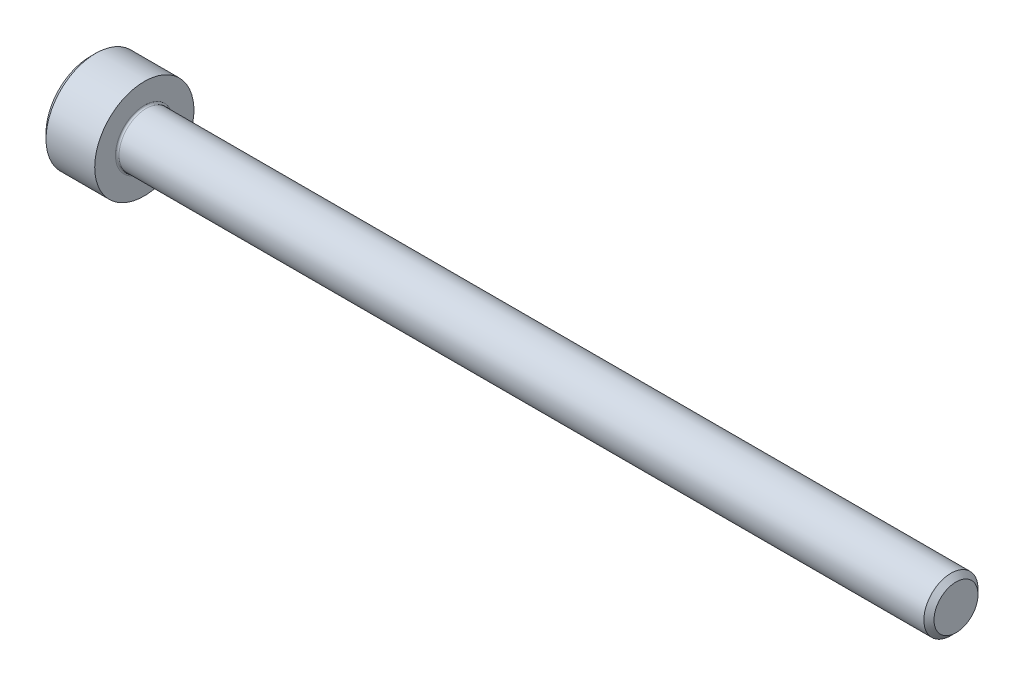
ISO-10303-21;
HEADER;
FILE_DESCRIPTION(('STEP AP214'),'2;1');
FILE_NAME('part.step','',(''),(''),'','','');
FILE_SCHEMA(('AUTOMOTIVE_DESIGN { 1 0 10303 214 1 1 1 1 }'));
ENDSEC;
DATA;
#1=APPLICATION_CONTEXT('core data for automotive mechanical design processes');
#2=APPLICATION_PROTOCOL_DEFINITION('international standard','automotive_design',2000,#1);
#3=PRODUCT_CONTEXT('',#1,'mechanical');
#4=PRODUCT('Part','Part','',(#3));
#5=PRODUCT_RELATED_PRODUCT_CATEGORY('part','',(#4));
#6=PRODUCT_DEFINITION_FORMATION('','',#4);
#7=PRODUCT_DEFINITION_CONTEXT('part definition',#1,'design');
#8=PRODUCT_DEFINITION('design','',#6,#7);
#9=PRODUCT_DEFINITION_SHAPE('','',#8);
#10=(LENGTH_UNIT() NAMED_UNIT(*) SI_UNIT(.MILLI.,.METRE.));
#11=(NAMED_UNIT(*) PLANE_ANGLE_UNIT() SI_UNIT($,.RADIAN.));
#12=(NAMED_UNIT(*) SI_UNIT($,.STERADIAN.) SOLID_ANGLE_UNIT());
#13=UNCERTAINTY_MEASURE_WITH_UNIT(LENGTH_MEASURE(1.E-05),#10,'distance_accuracy_value','');
#14=(GEOMETRIC_REPRESENTATION_CONTEXT(3) GLOBAL_UNCERTAINTY_ASSIGNED_CONTEXT((#13)) GLOBAL_UNIT_ASSIGNED_CONTEXT((#10,
#11,#12)) REPRESENTATION_CONTEXT('',''));
#15=CARTESIAN_POINT('',(0.,0.,0.));
#16=DIRECTION('',(0.,0.,1.));
#17=DIRECTION('',(1.,0.,0.));
#18=AXIS2_PLACEMENT_3D('',#15,#16,#17);
#19=CARTESIAN_POINT('',(0.,0.,0.));
#20=DIRECTION('',(-1.,0.,0.));
#21=DIRECTION('',(0.,0.,1.));
#22=AXIS2_PLACEMENT_3D('',#19,#20,#21);
#23=PLANE('',#22);
#24=DIRECTION('',(0.,-0.5,0.866025403784439));
#25=VECTOR('',#24,1.);
#26=CARTESIAN_POINT('',(0.,1.47801668912544,0.));
#27=LINE('',#26,#25);
#28=CARTESIAN_POINT('',(0.,1.47801668912544,0.));
#29=VERTEX_POINT('',#28);
#30=CARTESIAN_POINT('',(0.,0.739008344562719,1.28));
#31=VERTEX_POINT('',#30);
#32=EDGE_CURVE('E386',#29,#31,#27,.T.);
#33=ORIENTED_EDGE('',*,*,#32,.T.);
#34=DIRECTION('',(0.,1.,0.));
#35=VECTOR('',#34,1.);
#36=CARTESIAN_POINT('',(0.,-0.739008344562723,1.28));
#37=LINE('',#36,#35);
#38=CARTESIAN_POINT('',(0.,-0.739008344562723,1.28));
#39=VERTEX_POINT('',#38);
#40=EDGE_CURVE('E130',#39,#31,#37,.T.);
#41=ORIENTED_EDGE('',*,*,#40,.F.);
#42=DIRECTION('',(0.,-0.500000000000001,-0.866025403784438));
#43=VECTOR('',#42,1.);
#44=CARTESIAN_POINT('',(0.,-0.739008344562723,1.28));
#45=LINE('',#44,#43);
#46=CARTESIAN_POINT('',(0.,-1.47801668912545,0.));
#47=VERTEX_POINT('',#46);
#48=EDGE_CURVE('E389',#39,#47,#45,.T.);
#49=ORIENTED_EDGE('',*,*,#48,.T.);
#50=DIRECTION('',(0.,0.5,-0.866025403784439));
#51=VECTOR('',#50,1.);
#52=CARTESIAN_POINT('',(0.,-1.47801668912545,0.));
#53=LINE('',#52,#51);
#54=CARTESIAN_POINT('',(0.,-0.739008344562725,-1.28));
#55=VERTEX_POINT('',#54);
#56=EDGE_CURVE('E392',#47,#55,#53,.T.);
#57=ORIENTED_EDGE('',*,*,#56,.T.);
#58=DIRECTION('',(0.,-1.,0.));
#59=VECTOR('',#58,1.);
#60=CARTESIAN_POINT('',(0.,0.739008344562717,-1.28));
#61=LINE('',#60,#59);
#62=CARTESIAN_POINT('',(0.,0.739008344562717,-1.28));
#63=VERTEX_POINT('',#62);
#64=EDGE_CURVE('E395',#63,#55,#61,.T.);
#65=ORIENTED_EDGE('',*,*,#64,.F.);
#66=DIRECTION('',(0.,-0.500000000000001,-0.866025403784438));
#67=VECTOR('',#66,1.);
#68=CARTESIAN_POINT('',(0.,1.47801668912544,0.));
#69=LINE('',#68,#67);
#70=EDGE_CURVE('E125',#29,#63,#69,.T.);
#71=ORIENTED_EDGE('',*,*,#70,.F.);
#72=EDGE_LOOP('',(#33,#41,#49,#57,#65,#71));
#73=FACE_BOUND('',#72,.T.);
#74=CARTESIAN_POINT('',(0.,0.,0.));
#75=DIRECTION('',(-1.,0.,0.));
#76=DIRECTION('',(0.,0.,1.));
#77=AXIS2_PLACEMENT_3D('',#74,#75,#76);
#78=CIRCLE('',#77,2.45);
#79=CARTESIAN_POINT('',(0.,0.,2.45));
#80=VERTEX_POINT('',#79);
#81=EDGE_CURVE('E141',#80,#80,#78,.T.);
#82=ORIENTED_EDGE('',*,*,#81,.T.);
#83=EDGE_LOOP('',(#82));
#84=FACE_BOUND('',#83,.T.);
#85=ADVANCED_FACE('F34',(#73,#84),#23,.T.);
#86=CARTESIAN_POINT('',(48.,1.2195,0.));
#87=DIRECTION('',(1.,0.,0.));
#88=DIRECTION('',(0.,0.,-1.));
#89=AXIS2_PLACEMENT_3D('',#86,#87,#88);
#90=PLANE('',#89);
#91=CARTESIAN_POINT('',(48.,0.,0.));
#92=DIRECTION('',(-1.,0.,0.));
#93=DIRECTION('',(0.,0.,1.));
#94=AXIS2_PLACEMENT_3D('',#91,#92,#93);
#95=CIRCLE('',#94,1.2195);
#96=CARTESIAN_POINT('',(48.,0.,1.2195));
#97=VERTEX_POINT('',#96);
#98=EDGE_CURVE('E154',#97,#97,#95,.T.);
#99=ORIENTED_EDGE('',*,*,#98,.F.);
#100=EDGE_LOOP('',(#99));
#101=FACE_BOUND('',#100,.T.);
#102=ADVANCED_FACE('F175',(#101),#90,.T.);
#103=CARTESIAN_POINT('',(48.,0.,0.));
#104=DIRECTION('',(-1.,0.,0.));
#105=DIRECTION('',(0.,0.,1.));
#106=AXIS2_PLACEMENT_3D('',#103,#104,#105);
#107=CONICAL_SURFACE('',#106,1.2195,0.785398163397254);
#108=CARTESIAN_POINT('',(47.7195,0.,0.));
#109=DIRECTION('',(-1.,0.,0.));
#110=DIRECTION('',(0.,0.,1.));
#111=AXIS2_PLACEMENT_3D('',#108,#109,#110);
#112=CIRCLE('',#111,1.49999999999994);
#113=CARTESIAN_POINT('',(47.7195,0.,1.49999999999994));
#114=VERTEX_POINT('',#113);
#115=EDGE_CURVE('E151',#114,#114,#112,.T.);
#116=ORIENTED_EDGE('',*,*,#115,.F.);
#117=EDGE_LOOP('',(#116));
#118=FACE_BOUND('',#117,.T.);
#119=ORIENTED_EDGE('',*,*,#98,.T.);
#120=EDGE_LOOP('',(#119));
#121=FACE_BOUND('',#120,.T.);
#122=ADVANCED_FACE('F181',(#118,#121),#107,.T.);
#123=CARTESIAN_POINT('',(-31.75,0.,0.));
#124=DIRECTION('',(-1.,0.,0.));
#125=DIRECTION('',(0.,0.,1.));
#126=AXIS2_PLACEMENT_3D('',#123,#124,#125);
#127=CYLINDRICAL_SURFACE('',#126,1.49999999999997);
#128=CARTESIAN_POINT('',(3.1,0.,0.));
#129=DIRECTION('',(1.,0.,0.));
#130=DIRECTION('',(0.,0.,-1.));
#131=AXIS2_PLACEMENT_3D('',#128,#129,#130);
#132=CIRCLE('',#131,1.49999999999997);
#133=CARTESIAN_POINT('',(3.1,0.,-1.49999999999997));
#134=VERTEX_POINT('',#133);
#135=EDGE_CURVE('E11',#134,#134,#132,.T.);
#136=ORIENTED_EDGE('',*,*,#135,.T.);
#137=EDGE_LOOP('',(#136));
#138=FACE_BOUND('',#137,.T.);
#139=ORIENTED_EDGE('',*,*,#115,.T.);
#140=EDGE_LOOP('',(#139));
#141=FACE_BOUND('',#140,.T.);
#142=ADVANCED_FACE('F192',(#138,#141),#127,.T.);
#143=CARTESIAN_POINT('',(3.,2.75,0.));
#144=DIRECTION('',(1.,0.,0.));
#145=DIRECTION('',(0.,0.,-1.));
#146=AXIS2_PLACEMENT_3D('',#143,#144,#145);
#147=PLANE('',#146);
#148=CARTESIAN_POINT('',(3.,0.,0.));
#149=DIRECTION('',(1.,0.,0.));
#150=DIRECTION('',(0.,0.,-1.));
#151=AXIS2_PLACEMENT_3D('',#148,#149,#150);
#152=CIRCLE('',#151,1.59999999999997);
#153=CARTESIAN_POINT('',(3.,0.,-1.59999999999997));
#154=VERTEX_POINT('',#153);
#155=EDGE_CURVE('E42',#154,#154,#152,.F.);
#156=ORIENTED_EDGE('',*,*,#155,.T.);
#157=EDGE_LOOP('',(#156));
#158=FACE_BOUND('',#157,.T.);
#159=CARTESIAN_POINT('',(3.,0.,0.));
#160=DIRECTION('',(-1.,0.,0.));
#161=DIRECTION('',(0.,0.,1.));
#162=AXIS2_PLACEMENT_3D('',#159,#160,#161);
#163=CIRCLE('',#162,2.75);
#164=CARTESIAN_POINT('',(3.,0.,2.75));
#165=VERTEX_POINT('',#164);
#166=EDGE_CURVE('E148',#165,#165,#163,.T.);
#167=ORIENTED_EDGE('',*,*,#166,.F.);
#168=EDGE_LOOP('',(#167));
#169=FACE_BOUND('',#168,.T.);
#170=ADVANCED_FACE('F159',(#158,#169),#147,.T.);
#171=CARTESIAN_POINT('',(-31.75,0.,0.));
#172=DIRECTION('',(-1.,0.,0.));
#173=DIRECTION('',(0.,0.,1.));
#174=AXIS2_PLACEMENT_3D('',#171,#172,#173);
#175=CYLINDRICAL_SURFACE('',#174,2.75);
#176=ORIENTED_EDGE('',*,*,#166,.T.);
#177=EDGE_LOOP('',(#176));
#178=FACE_BOUND('',#177,.T.);
#179=CARTESIAN_POINT('',(0.300000000000002,0.,0.));
#180=DIRECTION('',(-1.,0.,0.));
#181=DIRECTION('',(0.,0.,1.));
#182=AXIS2_PLACEMENT_3D('',#179,#180,#181);
#183=CIRCLE('',#182,2.75);
#184=CARTESIAN_POINT('',(0.300000000000002,0.,2.75));
#185=VERTEX_POINT('',#184);
#186=EDGE_CURVE('E145',#185,#185,#183,.T.);
#187=ORIENTED_EDGE('',*,*,#186,.F.);
#188=EDGE_LOOP('',(#187));
#189=FACE_BOUND('',#188,.T.);
#190=ADVANCED_FACE('F170',(#178,#189),#175,.T.);
#191=CARTESIAN_POINT('',(0.,0.,0.));
#192=DIRECTION('',(1.,0.,0.));
#193=DIRECTION('',(0.,0.,-1.));
#194=AXIS2_PLACEMENT_3D('',#191,#192,#193);
#195=CONICAL_SURFACE('',#194,2.45,0.785398163397447);
#196=ORIENTED_EDGE('',*,*,#186,.T.);
#197=EDGE_LOOP('',(#196));
#198=FACE_BOUND('',#197,.T.);
#199=ORIENTED_EDGE('',*,*,#81,.F.);
#200=EDGE_LOOP('',(#199));
#201=FACE_BOUND('',#200,.T.);
#202=ADVANCED_FACE('F163',(#198,#201),#195,.T.);
#203=CARTESIAN_POINT('',(3.1,0.,0.));
#204=DIRECTION('',(1.,0.,0.));
#205=DIRECTION('',(0.,0.,-1.));
#206=AXIS2_PLACEMENT_3D('',#203,#204,#205);
#207=TOROIDAL_SURFACE('',#206,1.59999999999997,0.1);
#208=ORIENTED_EDGE('',*,*,#135,.F.);
#209=EDGE_LOOP('',(#208));
#210=FACE_BOUND('',#209,.T.);
#211=ORIENTED_EDGE('',*,*,#155,.F.);
#212=EDGE_LOOP('',(#211));
#213=FACE_BOUND('',#212,.T.);
#214=ADVANCED_FACE('F36',(#210,#213),#207,.F.);
#215=CARTESIAN_POINT('',(1.3,1.47801668912544,0.));
#216=DIRECTION('',(0.,-0.866025403784439,-0.5));
#217=DIRECTION('',(0.,0.5,-0.866025403784439));
#218=AXIS2_PLACEMENT_3D('',#215,#216,#217);
#219=PLANE('',#218);
#220=ORIENTED_EDGE('',*,*,#32,.F.);
#221=DIRECTION('',(-1.,0.,0.));
#222=VECTOR('',#221,1.);
#223=CARTESIAN_POINT('',(1.3,1.47801668912544,0.));
#224=LINE('',#223,#222);
#225=CARTESIAN_POINT('',(1.3,1.47801668912544,0.));
#226=VERTEX_POINT('',#225);
#227=EDGE_CURVE('E376',#226,#29,#224,.T.);
#228=ORIENTED_EDGE('',*,*,#227,.F.);
#229=DIRECTION('',(0.,-0.5,0.866025403784439));
#230=VECTOR('',#229,1.);
#231=CARTESIAN_POINT('',(1.3,1.47801668912544,0.));
#232=LINE('',#231,#230);
#233=CARTESIAN_POINT('',(1.3,1.10851251684408,0.639999999999998));
#234=VERTEX_POINT('',#233);
#235=EDGE_CURVE('E117',#226,#234,#232,.T.);
#236=ORIENTED_EDGE('',*,*,#235,.T.);
#237=CARTESIAN_POINT('',(1.3,0.739008344562719,1.28));
#238=VERTEX_POINT('',#237);
#239=EDGE_CURVE('E108',#234,#238,#232,.T.);
#240=ORIENTED_EDGE('',*,*,#239,.T.);
#241=DIRECTION('',(-1.,0.,0.));
#242=VECTOR('',#241,1.);
#243=CARTESIAN_POINT('',(1.3,0.739008344562719,1.28));
#244=LINE('',#243,#242);
#245=EDGE_CURVE('E122',#238,#31,#244,.T.);
#246=ORIENTED_EDGE('',*,*,#245,.T.);
#247=EDGE_LOOP('',(#220,#228,#236,#240,#246));
#248=FACE_BOUND('',#247,.T.);
#249=ADVANCED_FACE('F121',(#248),#219,.T.);
#250=CARTESIAN_POINT('',(1.3,-0.739008344562723,1.28));
#251=DIRECTION('',(0.,0.,1.));
#252=DIRECTION('',(0.,-1.,0.));
#253=AXIS2_PLACEMENT_3D('',#250,#251,#252);
#254=PLANE('',#253);
#255=ORIENTED_EDGE('',*,*,#40,.T.);
#256=ORIENTED_EDGE('',*,*,#245,.F.);
#257=DIRECTION('',(0.,1.,0.));
#258=VECTOR('',#257,1.);
#259=CARTESIAN_POINT('',(1.3,-0.739008344562723,1.28));
#260=LINE('',#259,#258);
#261=CARTESIAN_POINT('',(1.3,0.,1.28));
#262=VERTEX_POINT('',#261);
#263=EDGE_CURVE('E105',#262,#238,#260,.T.);
#264=ORIENTED_EDGE('',*,*,#263,.F.);
#265=CARTESIAN_POINT('',(1.3,-0.739008344562723,1.28));
#266=VERTEX_POINT('',#265);
#267=EDGE_CURVE('E116',#266,#262,#260,.T.);
#268=ORIENTED_EDGE('',*,*,#267,.F.);
#269=DIRECTION('',(-1.,0.,0.));
#270=VECTOR('',#269,1.);
#271=CARTESIAN_POINT('',(1.3,-0.739008344562723,1.28));
#272=LINE('',#271,#270);
#273=EDGE_CURVE('E132',#266,#39,#272,.T.);
#274=ORIENTED_EDGE('',*,*,#273,.T.);
#275=EDGE_LOOP('',(#255,#256,#264,#268,#274));
#276=FACE_BOUND('',#275,.T.);
#277=ADVANCED_FACE('F127',(#276),#254,.F.);
#278=CARTESIAN_POINT('',(1.3,-0.739008344562723,1.28));
#279=DIRECTION('',(0.,0.866025403784438,-0.500000000000001));
#280=DIRECTION('',(0.,0.500000000000001,0.866025403784438));
#281=AXIS2_PLACEMENT_3D('',#278,#279,#280);
#282=PLANE('',#281);
#283=ORIENTED_EDGE('',*,*,#48,.F.);
#284=ORIENTED_EDGE('',*,*,#273,.F.);
#285=DIRECTION('',(0.,-0.500000000000001,-0.866025403784438));
#286=VECTOR('',#285,1.);
#287=CARTESIAN_POINT('',(1.3,-0.739008344562723,1.28));
#288=LINE('',#287,#286);
#289=CARTESIAN_POINT('',(1.3,-1.10851251684408,0.640000000000003));
#290=VERTEX_POINT('',#289);
#291=EDGE_CURVE('E415',#266,#290,#288,.T.);
#292=ORIENTED_EDGE('',*,*,#291,.T.);
#293=CARTESIAN_POINT('',(1.3,-1.47801668912545,0.));
#294=VERTEX_POINT('',#293);
#295=EDGE_CURVE('E404',#290,#294,#288,.T.);
#296=ORIENTED_EDGE('',*,*,#295,.T.);
#297=DIRECTION('',(-1.,0.,0.));
#298=VECTOR('',#297,1.);
#299=CARTESIAN_POINT('',(1.3,-1.47801668912545,0.));
#300=LINE('',#299,#298);
#301=EDGE_CURVE('E137',#294,#47,#300,.T.);
#302=ORIENTED_EDGE('',*,*,#301,.T.);
#303=EDGE_LOOP('',(#283,#284,#292,#296,#302));
#304=FACE_BOUND('',#303,.T.);
#305=ADVANCED_FACE('F267',(#304),#282,.T.);
#306=CARTESIAN_POINT('',(1.3,-1.47801668912545,0.));
#307=DIRECTION('',(0.,0.866025403784439,0.5));
#308=DIRECTION('',(0.,-0.5,0.866025403784439));
#309=AXIS2_PLACEMENT_3D('',#306,#307,#308);
#310=PLANE('',#309);
#311=ORIENTED_EDGE('',*,*,#56,.F.);
#312=ORIENTED_EDGE('',*,*,#301,.F.);
#313=DIRECTION('',(0.,0.5,-0.866025403784439));
#314=VECTOR('',#313,1.);
#315=CARTESIAN_POINT('',(1.3,-1.47801668912545,0.));
#316=LINE('',#315,#314);
#317=CARTESIAN_POINT('',(1.3,-1.10851251684409,-0.640000000000002));
#318=VERTEX_POINT('',#317);
#319=EDGE_CURVE('E382',#294,#318,#316,.T.);
#320=ORIENTED_EDGE('',*,*,#319,.T.);
#321=CARTESIAN_POINT('',(1.3,-0.739008344562725,-1.28));
#322=VERTEX_POINT('',#321);
#323=EDGE_CURVE('E414',#318,#322,#316,.T.);
#324=ORIENTED_EDGE('',*,*,#323,.T.);
#325=DIRECTION('',(-1.,0.,0.));
#326=VECTOR('',#325,1.);
#327=CARTESIAN_POINT('',(1.3,-0.739008344562725,-1.28));
#328=LINE('',#327,#326);
#329=EDGE_CURVE('E375',#322,#55,#328,.T.);
#330=ORIENTED_EDGE('',*,*,#329,.T.);
#331=EDGE_LOOP('',(#311,#312,#320,#324,#330));
#332=FACE_BOUND('',#331,.T.);
#333=ADVANCED_FACE('F275',(#332),#310,.T.);
#334=CARTESIAN_POINT('',(1.3,0.739008344562717,-1.28));
#335=DIRECTION('',(0.,0.,-1.));
#336=DIRECTION('',(0.,1.,0.));
#337=AXIS2_PLACEMENT_3D('',#334,#335,#336);
#338=PLANE('',#337);
#339=ORIENTED_EDGE('',*,*,#64,.T.);
#340=ORIENTED_EDGE('',*,*,#329,.F.);
#341=DIRECTION('',(0.,-1.,0.));
#342=VECTOR('',#341,1.);
#343=CARTESIAN_POINT('',(1.3,0.739008344562717,-1.28));
#344=LINE('',#343,#342);
#345=CARTESIAN_POINT('',(1.3,0.,-1.28));
#346=VERTEX_POINT('',#345);
#347=EDGE_CURVE('E379',#346,#322,#344,.T.);
#348=ORIENTED_EDGE('',*,*,#347,.F.);
#349=CARTESIAN_POINT('',(1.3,0.739008344562717,-1.28));
#350=VERTEX_POINT('',#349);
#351=EDGE_CURVE('E49',#350,#346,#344,.T.);
#352=ORIENTED_EDGE('',*,*,#351,.F.);
#353=DIRECTION('',(-1.,0.,0.));
#354=VECTOR('',#353,1.);
#355=CARTESIAN_POINT('',(1.3,0.739008344562717,-1.28));
#356=LINE('',#355,#354);
#357=EDGE_CURVE('E372',#350,#63,#356,.T.);
#358=ORIENTED_EDGE('',*,*,#357,.T.);
#359=EDGE_LOOP('',(#339,#340,#348,#352,#358));
#360=FACE_BOUND('',#359,.T.);
#361=ADVANCED_FACE('F284',(#360),#338,.F.);
#362=CARTESIAN_POINT('',(1.3,1.47801668912544,0.));
#363=DIRECTION('',(0.,0.866025403784438,-0.500000000000001));
#364=DIRECTION('',(0.,0.500000000000001,0.866025403784438));
#365=AXIS2_PLACEMENT_3D('',#362,#363,#364);
#366=PLANE('',#365);
#367=ORIENTED_EDGE('',*,*,#70,.T.);
#368=ORIENTED_EDGE('',*,*,#357,.F.);
#369=DIRECTION('',(0.,-0.500000000000001,-0.866025403784438));
#370=VECTOR('',#369,1.);
#371=CARTESIAN_POINT('',(1.3,1.47801668912544,0.));
#372=LINE('',#371,#370);
#373=CARTESIAN_POINT('',(1.3,1.10851251684408,-0.640000000000001));
#374=VERTEX_POINT('',#373);
#375=EDGE_CURVE('E362',#374,#350,#372,.T.);
#376=ORIENTED_EDGE('',*,*,#375,.F.);
#377=EDGE_CURVE('E368',#226,#374,#372,.T.);
#378=ORIENTED_EDGE('',*,*,#377,.F.);
#379=ORIENTED_EDGE('',*,*,#227,.T.);
#380=EDGE_LOOP('',(#367,#368,#376,#378,#379));
#381=FACE_BOUND('',#380,.T.);
#382=ADVANCED_FACE('F293',(#381),#366,.F.);
#383=CARTESIAN_POINT('',(1.3,1.47801668912544,0.));
#384=DIRECTION('',(1.,0.,0.));
#385=DIRECTION('',(0.,0.,-1.));
#386=AXIS2_PLACEMENT_3D('',#383,#384,#385);
#387=PLANE('',#386);
#388=ORIENTED_EDGE('',*,*,#347,.T.);
#389=ORIENTED_EDGE('',*,*,#323,.F.);
#390=CARTESIAN_POINT('',(1.3,0.,0.));
#391=DIRECTION('',(-1.,0.,0.));
#392=DIRECTION('',(0.,0.,1.));
#393=AXIS2_PLACEMENT_3D('',#390,#391,#392);
#394=CIRCLE('',#393,1.28);
#395=EDGE_CURVE('E410',#346,#318,#394,.T.);
#396=ORIENTED_EDGE('',*,*,#395,.F.);
#397=EDGE_LOOP('',(#388,#389,#396));
#398=FACE_BOUND('',#397,.T.);
#399=ADVANCED_FACE('F302',(#398),#387,.F.);
#400=ORIENTED_EDGE('',*,*,#319,.F.);
#401=ORIENTED_EDGE('',*,*,#295,.F.);
#402=EDGE_CURVE('E135',#318,#290,#394,.T.);
#403=ORIENTED_EDGE('',*,*,#402,.F.);
#404=EDGE_LOOP('',(#400,#401,#403));
#405=FACE_BOUND('',#404,.T.);
#406=ADVANCED_FACE('F311',(#405),#387,.F.);
#407=ORIENTED_EDGE('',*,*,#291,.F.);
#408=ORIENTED_EDGE('',*,*,#267,.T.);
#409=EDGE_CURVE('E131',#290,#262,#394,.T.);
#410=ORIENTED_EDGE('',*,*,#409,.F.);
#411=EDGE_LOOP('',(#407,#408,#410));
#412=FACE_BOUND('',#411,.T.);
#413=ADVANCED_FACE('F320',(#412),#387,.F.);
#414=ORIENTED_EDGE('',*,*,#263,.T.);
#415=ORIENTED_EDGE('',*,*,#239,.F.);
#416=EDGE_CURVE('E111',#262,#234,#394,.T.);
#417=ORIENTED_EDGE('',*,*,#416,.F.);
#418=EDGE_LOOP('',(#414,#415,#417));
#419=FACE_BOUND('',#418,.T.);
#420=ADVANCED_FACE('F107',(#419),#387,.F.);
#421=ORIENTED_EDGE('',*,*,#235,.F.);
#422=ORIENTED_EDGE('',*,*,#377,.T.);
#423=EDGE_CURVE('E142',#234,#374,#394,.T.);
#424=ORIENTED_EDGE('',*,*,#423,.F.);
#425=EDGE_LOOP('',(#421,#422,#424));
#426=FACE_BOUND('',#425,.T.);
#427=ADVANCED_FACE('F335',(#426),#387,.F.);
#428=ORIENTED_EDGE('',*,*,#375,.T.);
#429=ORIENTED_EDGE('',*,*,#351,.T.);
#430=EDGE_CURVE('E365',#374,#346,#394,.T.);
#431=ORIENTED_EDGE('',*,*,#430,.F.);
#432=EDGE_LOOP('',(#428,#429,#431));
#433=FACE_BOUND('',#432,.T.);
#434=ADVANCED_FACE('F250',(#433),#387,.F.);
#435=CARTESIAN_POINT('',(1.3,0.,0.));
#436=DIRECTION('',(-1.,0.,0.));
#437=DIRECTION('',(0.,0.,1.));
#438=AXIS2_PLACEMENT_3D('',#435,#436,#437);
#439=CONICAL_SURFACE('',#438,1.28,1.0471975511966);
#440=CARTESIAN_POINT('',(2.03900834456273,0.,0.));
#441=VERTEX_POINT('',#440);
#442=VERTEX_LOOP('',#441);
#443=FACE_BOUND('',#442,.T.);
#444=ORIENTED_EDGE('',*,*,#416,.T.);
#445=ORIENTED_EDGE('',*,*,#423,.T.);
#446=ORIENTED_EDGE('',*,*,#430,.T.);
#447=ORIENTED_EDGE('',*,*,#395,.T.);
#448=ORIENTED_EDGE('',*,*,#402,.T.);
#449=ORIENTED_EDGE('',*,*,#409,.T.);
#450=EDGE_LOOP('',(#444,#445,#446,#447,#448,#449));
#451=FACE_BOUND('',#450,.T.);
#452=ADVANCED_FACE('F185',(#443,#451),#439,.F.);
#453=CLOSED_SHELL('',(#85,#102,#122,#142,#170,#190,#202,#214,#249,#277,#305,#333,#361,#382,#399,
#406,#413,#420,#427,#434,#452));
#454=MANIFOLD_SOLID_BREP('B2',#453);
#455=ADVANCED_BREP_SHAPE_REPRESENTATION('',(#18,#454),#14);
#456=SHAPE_DEFINITION_REPRESENTATION(#9,#455);
ENDSEC;
END-ISO-10303-21;
